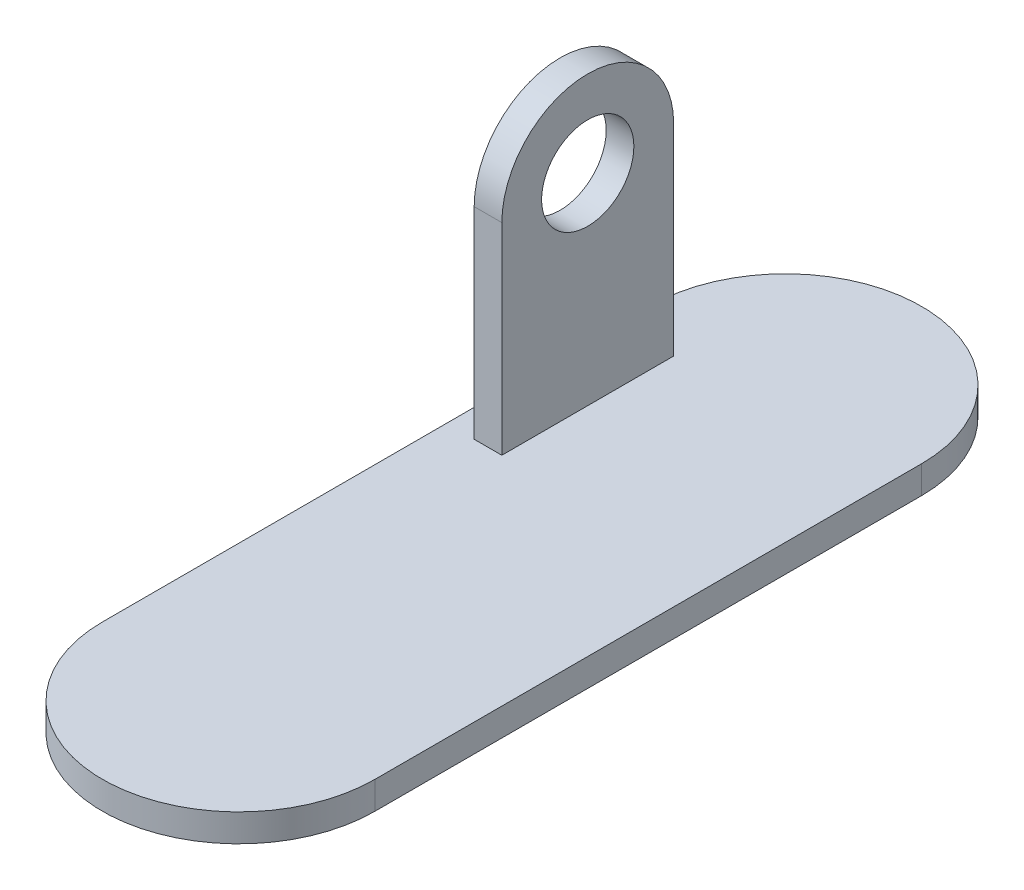
ISO-10303-21;
HEADER;
FILE_DESCRIPTION(('STEP AP214'),'2;1');
FILE_NAME('part.step','',(''),(''),'','','');
FILE_SCHEMA(('AUTOMOTIVE_DESIGN { 1 0 10303 214 1 1 1 1 }'));
ENDSEC;
DATA;
#1=APPLICATION_CONTEXT('core data for automotive mechanical design processes');
#2=APPLICATION_PROTOCOL_DEFINITION('international standard','automotive_design',2000,#1);
#3=PRODUCT_CONTEXT('',#1,'mechanical');
#4=PRODUCT('Part','Part','',(#3));
#5=PRODUCT_RELATED_PRODUCT_CATEGORY('part','',(#4));
#6=PRODUCT_DEFINITION_FORMATION('','',#4);
#7=PRODUCT_DEFINITION_CONTEXT('part definition',#1,'design');
#8=PRODUCT_DEFINITION('design','',#6,#7);
#9=PRODUCT_DEFINITION_SHAPE('','',#8);
#10=(LENGTH_UNIT() NAMED_UNIT(*) SI_UNIT(.MILLI.,.METRE.));
#11=(NAMED_UNIT(*) PLANE_ANGLE_UNIT() SI_UNIT($,.RADIAN.));
#12=(NAMED_UNIT(*) SI_UNIT($,.STERADIAN.) SOLID_ANGLE_UNIT());
#13=UNCERTAINTY_MEASURE_WITH_UNIT(LENGTH_MEASURE(1.E-05),#10,'distance_accuracy_value','');
#14=(GEOMETRIC_REPRESENTATION_CONTEXT(3) GLOBAL_UNCERTAINTY_ASSIGNED_CONTEXT((#13)) GLOBAL_UNIT_ASSIGNED_CONTEXT((#10,
#11,#12)) REPRESENTATION_CONTEXT('',''));
#15=CARTESIAN_POINT('',(0.,0.,0.));
#16=DIRECTION('',(0.,0.,1.));
#17=DIRECTION('',(1.,0.,0.));
#18=AXIS2_PLACEMENT_3D('',#15,#16,#17);
#19=CARTESIAN_POINT('',(0.,9.,-88.9));
#20=DIRECTION('',(0.,1.,0.));
#21=DIRECTION('',(0.,0.,1.));
#22=AXIS2_PLACEMENT_3D('',#19,#20,#21);
#23=PLANE('',#22);
#24=CARTESIAN_POINT('',(0.,9.,-88.9));
#25=DIRECTION('',(0.,1.,0.));
#26=DIRECTION('',(0.,0.,1.));
#27=AXIS2_PLACEMENT_3D('',#24,#25,#26);
#28=CIRCLE('',#27,44.323);
#29=CARTESIAN_POINT('',(44.323,9.,-88.9));
#30=VERTEX_POINT('',#29);
#31=CARTESIAN_POINT('',(-44.323,9.,-88.9));
#32=VERTEX_POINT('',#31);
#33=EDGE_CURVE('E176',#30,#32,#28,.T.);
#34=ORIENTED_EDGE('',*,*,#33,.T.);
#35=DIRECTION('',(0.,0.,1.));
#36=VECTOR('',#35,1.);
#37=CARTESIAN_POINT('',(-44.323,9.,-88.9));
#38=LINE('',#37,#36);
#39=CARTESIAN_POINT('',(-44.323,9.,88.9));
#40=VERTEX_POINT('',#39);
#41=EDGE_CURVE('E100',#32,#40,#38,.T.);
#42=ORIENTED_EDGE('',*,*,#41,.T.);
#43=CARTESIAN_POINT('',(0.,9.,88.9));
#44=DIRECTION('',(0.,1.,0.));
#45=DIRECTION('',(0.,0.,1.));
#46=AXIS2_PLACEMENT_3D('',#43,#44,#45);
#47=CIRCLE('',#46,44.323);
#48=CARTESIAN_POINT('',(44.323,9.,88.9));
#49=VERTEX_POINT('',#48);
#50=EDGE_CURVE('E181',#40,#49,#47,.T.);
#51=ORIENTED_EDGE('',*,*,#50,.T.);
#52=DIRECTION('',(0.,0.,-1.));
#53=VECTOR('',#52,1.);
#54=CARTESIAN_POINT('',(44.323,9.,-88.9));
#55=LINE('',#54,#53);
#56=EDGE_CURVE('E72',#49,#30,#55,.T.);
#57=ORIENTED_EDGE('',*,*,#56,.T.);
#58=EDGE_LOOP('',(#34,#42,#51,#57));
#59=FACE_BOUND('',#58,.T.);
#60=DIRECTION('',(1.,0.,0.));
#61=VECTOR('',#60,1.);
#62=CARTESIAN_POINT('',(-35.323,9.,-23.02));
#63=LINE('',#62,#61);
#64=CARTESIAN_POINT('',(-35.323,9.,-23.02));
#65=VERTEX_POINT('',#64);
#66=CARTESIAN_POINT('',(-26.323,9.,-23.02));
#67=VERTEX_POINT('',#66);
#68=EDGE_CURVE('E154',#65,#67,#63,.T.);
#69=ORIENTED_EDGE('',*,*,#68,.F.);
#70=DIRECTION('',(0.,0.,1.));
#71=VECTOR('',#70,1.);
#72=CARTESIAN_POINT('',(-35.323,9.,-78.9));
#73=LINE('',#72,#71);
#74=CARTESIAN_POINT('',(-35.323,9.,-78.9));
#75=VERTEX_POINT('',#74);
#76=EDGE_CURVE('E129',#75,#65,#73,.T.);
#77=ORIENTED_EDGE('',*,*,#76,.F.);
#78=DIRECTION('',(-1.,0.,0.));
#79=VECTOR('',#78,1.);
#80=CARTESIAN_POINT('',(-35.323,9.,-78.9));
#81=LINE('',#80,#79);
#82=CARTESIAN_POINT('',(-26.323,9.,-78.9));
#83=VERTEX_POINT('',#82);
#84=EDGE_CURVE('E145',#83,#75,#81,.T.);
#85=ORIENTED_EDGE('',*,*,#84,.F.);
#86=DIRECTION('',(0.,0.,-1.));
#87=VECTOR('',#86,1.);
#88=CARTESIAN_POINT('',(-26.323,9.,-78.9));
#89=LINE('',#88,#87);
#90=EDGE_CURVE('E165',#67,#83,#89,.T.);
#91=ORIENTED_EDGE('',*,*,#90,.F.);
#92=EDGE_LOOP('',(#69,#77,#85,#91));
#93=FACE_BOUND('',#92,.T.);
#94=ADVANCED_FACE('F47',(#59,#93),#23,.T.);
#95=CARTESIAN_POINT('',(0.,9.,-88.9));
#96=DIRECTION('',(0.,-1.,0.));
#97=DIRECTION('',(0.,0.,-1.));
#98=AXIS2_PLACEMENT_3D('',#95,#96,#97);
#99=CYLINDRICAL_SURFACE('',#98,44.323);
#100=CARTESIAN_POINT('',(0.,0.,-88.9));
#101=DIRECTION('',(0.,1.,0.));
#102=DIRECTION('',(0.,0.,1.));
#103=AXIS2_PLACEMENT_3D('',#100,#101,#102);
#104=CIRCLE('',#103,44.323);
#105=CARTESIAN_POINT('',(44.323,0.,-88.9));
#106=VERTEX_POINT('',#105);
#107=CARTESIAN_POINT('',(-44.323,0.,-88.9));
#108=VERTEX_POINT('',#107);
#109=EDGE_CURVE('E133',#106,#108,#104,.T.);
#110=ORIENTED_EDGE('',*,*,#109,.T.);
#111=DIRECTION('',(0.,-1.,0.));
#112=VECTOR('',#111,1.);
#113=CARTESIAN_POINT('',(-44.323,9.,-88.9));
#114=LINE('',#113,#112);
#115=EDGE_CURVE('E11',#32,#108,#114,.T.);
#116=ORIENTED_EDGE('',*,*,#115,.F.);
#117=ORIENTED_EDGE('',*,*,#33,.F.);
#118=DIRECTION('',(0.,-1.,0.));
#119=VECTOR('',#118,1.);
#120=CARTESIAN_POINT('',(44.323,9.,-88.9));
#121=LINE('',#120,#119);
#122=EDGE_CURVE('E186',#30,#106,#121,.T.);
#123=ORIENTED_EDGE('',*,*,#122,.T.);
#124=EDGE_LOOP('',(#110,#116,#117,#123));
#125=FACE_BOUND('',#124,.T.);
#126=ADVANCED_FACE('F49',(#125),#99,.T.);
#127=CARTESIAN_POINT('',(-44.323,9.,-88.9));
#128=DIRECTION('',(1.,0.,0.));
#129=DIRECTION('',(0.,0.,-1.));
#130=AXIS2_PLACEMENT_3D('',#127,#128,#129);
#131=PLANE('',#130);
#132=DIRECTION('',(0.,0.,1.));
#133=VECTOR('',#132,1.);
#134=CARTESIAN_POINT('',(-44.323,0.,-88.9));
#135=LINE('',#134,#133);
#136=CARTESIAN_POINT('',(-44.323,0.,88.9));
#137=VERTEX_POINT('',#136);
#138=EDGE_CURVE('E190',#108,#137,#135,.T.);
#139=ORIENTED_EDGE('',*,*,#138,.T.);
#140=DIRECTION('',(0.,-1.,0.));
#141=VECTOR('',#140,1.);
#142=CARTESIAN_POINT('',(-44.323,9.,88.9));
#143=LINE('',#142,#141);
#144=EDGE_CURVE('E56',#40,#137,#143,.T.);
#145=ORIENTED_EDGE('',*,*,#144,.F.);
#146=ORIENTED_EDGE('',*,*,#41,.F.);
#147=ORIENTED_EDGE('',*,*,#115,.T.);
#148=EDGE_LOOP('',(#139,#145,#146,#147));
#149=FACE_BOUND('',#148,.T.);
#150=ADVANCED_FACE('F223',(#149),#131,.F.);
#151=CARTESIAN_POINT('',(0.,9.,88.9));
#152=DIRECTION('',(0.,-1.,0.));
#153=DIRECTION('',(0.,0.,-1.));
#154=AXIS2_PLACEMENT_3D('',#151,#152,#153);
#155=CYLINDRICAL_SURFACE('',#154,44.323);
#156=CARTESIAN_POINT('',(0.,0.,88.9));
#157=DIRECTION('',(0.,1.,0.));
#158=DIRECTION('',(0.,0.,1.));
#159=AXIS2_PLACEMENT_3D('',#156,#157,#158);
#160=CIRCLE('',#159,44.323);
#161=CARTESIAN_POINT('',(44.323,0.,88.9));
#162=VERTEX_POINT('',#161);
#163=EDGE_CURVE('E193',#137,#162,#160,.T.);
#164=ORIENTED_EDGE('',*,*,#163,.T.);
#165=DIRECTION('',(0.,-1.,0.));
#166=VECTOR('',#165,1.);
#167=CARTESIAN_POINT('',(44.323,9.,88.9));
#168=LINE('',#167,#166);
#169=EDGE_CURVE('E200',#49,#162,#168,.T.);
#170=ORIENTED_EDGE('',*,*,#169,.F.);
#171=ORIENTED_EDGE('',*,*,#50,.F.);
#172=ORIENTED_EDGE('',*,*,#144,.T.);
#173=EDGE_LOOP('',(#164,#170,#171,#172));
#174=FACE_BOUND('',#173,.T.);
#175=ADVANCED_FACE('F207',(#174),#155,.T.);
#176=CARTESIAN_POINT('',(44.323,9.,-88.9));
#177=DIRECTION('',(-1.,0.,0.));
#178=DIRECTION('',(0.,0.,1.));
#179=AXIS2_PLACEMENT_3D('',#176,#177,#178);
#180=PLANE('',#179);
#181=DIRECTION('',(0.,0.,-1.));
#182=VECTOR('',#181,1.);
#183=CARTESIAN_POINT('',(44.323,0.,-88.9));
#184=LINE('',#183,#182);
#185=EDGE_CURVE('E93',#162,#106,#184,.T.);
#186=ORIENTED_EDGE('',*,*,#185,.T.);
#187=ORIENTED_EDGE('',*,*,#122,.F.);
#188=ORIENTED_EDGE('',*,*,#56,.F.);
#189=ORIENTED_EDGE('',*,*,#169,.T.);
#190=EDGE_LOOP('',(#186,#187,#188,#189));
#191=FACE_BOUND('',#190,.T.);
#192=ADVANCED_FACE('F215',(#191),#180,.F.);
#193=CARTESIAN_POINT('',(0.,0.,-88.9));
#194=DIRECTION('',(0.,1.,0.));
#195=DIRECTION('',(0.,0.,1.));
#196=AXIS2_PLACEMENT_3D('',#193,#194,#195);
#197=PLANE('',#196);
#198=ORIENTED_EDGE('',*,*,#109,.F.);
#199=ORIENTED_EDGE('',*,*,#185,.F.);
#200=ORIENTED_EDGE('',*,*,#163,.F.);
#201=ORIENTED_EDGE('',*,*,#138,.F.);
#202=EDGE_LOOP('',(#198,#199,#200,#201));
#203=FACE_BOUND('',#202,.T.);
#204=ADVANCED_FACE('F211',(#203),#197,.F.);
#205=CARTESIAN_POINT('',(-35.323,74.53,-78.9));
#206=DIRECTION('',(1.,0.,0.));
#207=DIRECTION('',(0.,0.,-1.));
#208=AXIS2_PLACEMENT_3D('',#205,#206,#207);
#209=PLANE('',#208);
#210=CARTESIAN_POINT('',(-35.323,74.53,-50.96));
#211=DIRECTION('',(1.,0.,0.));
#212=DIRECTION('',(0.,0.,-1.));
#213=AXIS2_PLACEMENT_3D('',#210,#211,#212);
#214=CIRCLE('',#213,15.);
#215=CARTESIAN_POINT('',(-35.323,74.53,-65.96));
#216=VERTEX_POINT('',#215);
#217=EDGE_CURVE('E156',#216,#216,#214,.T.);
#218=ORIENTED_EDGE('',*,*,#217,.T.);
#219=EDGE_LOOP('',(#218));
#220=FACE_BOUND('',#219,.T.);
#221=DIRECTION('',(0.,-1.,0.));
#222=VECTOR('',#221,1.);
#223=CARTESIAN_POINT('',(-35.323,74.53,-23.02));
#224=LINE('',#223,#222);
#225=CARTESIAN_POINT('',(-35.323,74.53,-23.02));
#226=VERTEX_POINT('',#225);
#227=EDGE_CURVE('E122',#226,#65,#224,.T.);
#228=ORIENTED_EDGE('',*,*,#227,.F.);
#229=CARTESIAN_POINT('',(-35.323,74.53,-50.96));
#230=DIRECTION('',(1.,0.,0.));
#231=DIRECTION('',(0.,0.,-1.));
#232=AXIS2_PLACEMENT_3D('',#229,#230,#231);
#233=CIRCLE('',#232,27.94);
#234=CARTESIAN_POINT('',(-35.323,74.53,-78.9));
#235=VERTEX_POINT('',#234);
#236=EDGE_CURVE('E127',#226,#235,#233,.F.);
#237=ORIENTED_EDGE('',*,*,#236,.T.);
#238=DIRECTION('',(0.,-1.,0.));
#239=VECTOR('',#238,1.);
#240=CARTESIAN_POINT('',(-35.323,74.53,-78.9));
#241=LINE('',#240,#239);
#242=EDGE_CURVE('E161',#235,#75,#241,.T.);
#243=ORIENTED_EDGE('',*,*,#242,.T.);
#244=ORIENTED_EDGE('',*,*,#76,.T.);
#245=EDGE_LOOP('',(#228,#237,#243,#244));
#246=FACE_BOUND('',#245,.T.);
#247=ADVANCED_FACE('F124',(#220,#246),#209,.F.);
#248=CARTESIAN_POINT('',(-35.323,74.53,-23.02));
#249=DIRECTION('',(0.,0.,-1.));
#250=DIRECTION('',(-1.,0.,0.));
#251=AXIS2_PLACEMENT_3D('',#248,#249,#250);
#252=PLANE('',#251);
#253=ORIENTED_EDGE('',*,*,#68,.T.);
#254=DIRECTION('',(0.,-1.,0.));
#255=VECTOR('',#254,1.);
#256=CARTESIAN_POINT('',(-26.323,74.53,-23.02));
#257=LINE('',#256,#255);
#258=CARTESIAN_POINT('',(-26.323,74.53,-23.02));
#259=VERTEX_POINT('',#258);
#260=EDGE_CURVE('E134',#259,#67,#257,.T.);
#261=ORIENTED_EDGE('',*,*,#260,.F.);
#262=DIRECTION('',(1.,0.,0.));
#263=VECTOR('',#262,1.);
#264=CARTESIAN_POINT('',(-35.323,74.53,-23.02));
#265=LINE('',#264,#263);
#266=EDGE_CURVE('E137',#226,#259,#265,.T.);
#267=ORIENTED_EDGE('',*,*,#266,.F.);
#268=ORIENTED_EDGE('',*,*,#227,.T.);
#269=EDGE_LOOP('',(#253,#261,#267,#268));
#270=FACE_BOUND('',#269,.T.);
#271=ADVANCED_FACE('F138',(#270),#252,.F.);
#272=CARTESIAN_POINT('',(-26.323,74.53,-78.9));
#273=DIRECTION('',(-1.,0.,0.));
#274=DIRECTION('',(0.,0.,1.));
#275=AXIS2_PLACEMENT_3D('',#272,#273,#274);
#276=PLANE('',#275);
#277=CARTESIAN_POINT('',(-26.323,74.53,-50.96));
#278=DIRECTION('',(1.,0.,0.));
#279=DIRECTION('',(0.,0.,-1.));
#280=AXIS2_PLACEMENT_3D('',#277,#278,#279);
#281=CIRCLE('',#280,15.);
#282=CARTESIAN_POINT('',(-26.323,74.53,-65.96));
#283=VERTEX_POINT('',#282);
#284=EDGE_CURVE('E254',#283,#283,#281,.T.);
#285=ORIENTED_EDGE('',*,*,#284,.F.);
#286=EDGE_LOOP('',(#285));
#287=FACE_BOUND('',#286,.T.);
#288=DIRECTION('',(0.,-1.,0.));
#289=VECTOR('',#288,1.);
#290=CARTESIAN_POINT('',(-26.323,74.53,-78.9));
#291=LINE('',#290,#289);
#292=CARTESIAN_POINT('',(-26.323,74.53,-78.9));
#293=VERTEX_POINT('',#292);
#294=EDGE_CURVE('E63',#293,#83,#291,.T.);
#295=ORIENTED_EDGE('',*,*,#294,.F.);
#296=CARTESIAN_POINT('',(-26.323,74.53,-50.96));
#297=DIRECTION('',(1.,0.,0.));
#298=DIRECTION('',(0.,0.,-1.));
#299=AXIS2_PLACEMENT_3D('',#296,#297,#298);
#300=CIRCLE('',#299,27.94);
#301=EDGE_CURVE('E150',#293,#259,#300,.T.);
#302=ORIENTED_EDGE('',*,*,#301,.T.);
#303=ORIENTED_EDGE('',*,*,#260,.T.);
#304=ORIENTED_EDGE('',*,*,#90,.T.);
#305=EDGE_LOOP('',(#295,#302,#303,#304));
#306=FACE_BOUND('',#305,.T.);
#307=ADVANCED_FACE('F237',(#287,#306),#276,.F.);
#308=CARTESIAN_POINT('',(-35.323,74.53,-78.9));
#309=DIRECTION('',(0.,0.,1.));
#310=DIRECTION('',(1.,0.,0.));
#311=AXIS2_PLACEMENT_3D('',#308,#309,#310);
#312=PLANE('',#311);
#313=ORIENTED_EDGE('',*,*,#84,.T.);
#314=ORIENTED_EDGE('',*,*,#242,.F.);
#315=DIRECTION('',(-1.,0.,0.));
#316=VECTOR('',#315,1.);
#317=CARTESIAN_POINT('',(-35.323,74.53,-78.9));
#318=LINE('',#317,#316);
#319=EDGE_CURVE('E144',#293,#235,#318,.T.);
#320=ORIENTED_EDGE('',*,*,#319,.F.);
#321=ORIENTED_EDGE('',*,*,#294,.T.);
#322=EDGE_LOOP('',(#313,#314,#320,#321));
#323=FACE_BOUND('',#322,.T.);
#324=ADVANCED_FACE('F240',(#323),#312,.F.);
#325=CARTESIAN_POINT('',(-114.349253865409,74.53,-50.96));
#326=DIRECTION('',(1.,0.,0.));
#327=DIRECTION('',(0.,0.,-1.));
#328=AXIS2_PLACEMENT_3D('',#325,#326,#327);
#329=CYLINDRICAL_SURFACE('',#328,27.94);
#330=ORIENTED_EDGE('',*,*,#236,.F.);
#331=ORIENTED_EDGE('',*,*,#266,.T.);
#332=ORIENTED_EDGE('',*,*,#301,.F.);
#333=ORIENTED_EDGE('',*,*,#319,.T.);
#334=EDGE_LOOP('',(#330,#331,#332,#333));
#335=FACE_BOUND('',#334,.T.);
#336=ADVANCED_FACE('F148',(#335),#329,.T.);
#337=CARTESIAN_POINT('',(-44.323,74.53,-50.96));
#338=DIRECTION('',(1.,0.,0.));
#339=DIRECTION('',(0.,0.,-1.));
#340=AXIS2_PLACEMENT_3D('',#337,#338,#339);
#341=CYLINDRICAL_SURFACE('',#340,15.);
#342=ORIENTED_EDGE('',*,*,#284,.T.);
#343=EDGE_LOOP('',(#342));
#344=FACE_BOUND('',#343,.T.);
#345=ORIENTED_EDGE('',*,*,#217,.F.);
#346=EDGE_LOOP('',(#345));
#347=FACE_BOUND('',#346,.T.);
#348=ADVANCED_FACE('F246',(#344,#347),#341,.F.);
#349=CLOSED_SHELL('',(#94,#126,#150,#175,#192,#204,#247,#271,#307,#324,#336,#348));
#350=MANIFOLD_SOLID_BREP('B2',#349);
#351=ADVANCED_BREP_SHAPE_REPRESENTATION('',(#18,#350),#14);
#352=SHAPE_DEFINITION_REPRESENTATION(#9,#351);
ENDSEC;
END-ISO-10303-21;
